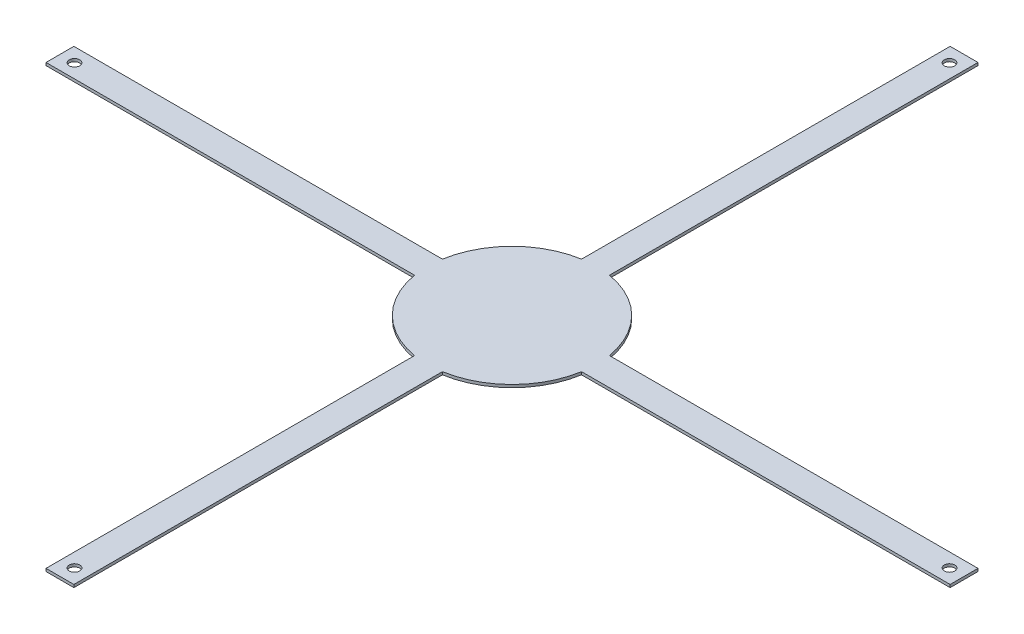
ISO-10303-21;
HEADER;
FILE_DESCRIPTION(('STEP AP214'),'2;1');
FILE_NAME('part.step','',(''),(''),'','','');
FILE_SCHEMA(('AUTOMOTIVE_DESIGN { 1 0 10303 214 1 1 1 1 }'));
ENDSEC;
DATA;
#1=APPLICATION_CONTEXT('core data for automotive mechanical design processes');
#2=APPLICATION_PROTOCOL_DEFINITION('international standard','automotive_design',2000,#1);
#3=PRODUCT_CONTEXT('',#1,'mechanical');
#4=PRODUCT('Part','Part','',(#3));
#5=PRODUCT_RELATED_PRODUCT_CATEGORY('part','',(#4));
#6=PRODUCT_DEFINITION_FORMATION('','',#4);
#7=PRODUCT_DEFINITION_CONTEXT('part definition',#1,'design');
#8=PRODUCT_DEFINITION('design','',#6,#7);
#9=PRODUCT_DEFINITION_SHAPE('','',#8);
#10=(LENGTH_UNIT() NAMED_UNIT(*) SI_UNIT(.MILLI.,.METRE.));
#11=(NAMED_UNIT(*) PLANE_ANGLE_UNIT() SI_UNIT($,.RADIAN.));
#12=(NAMED_UNIT(*) SI_UNIT($,.STERADIAN.) SOLID_ANGLE_UNIT());
#13=UNCERTAINTY_MEASURE_WITH_UNIT(LENGTH_MEASURE(1.E-05),#10,'distance_accuracy_value','');
#14=(GEOMETRIC_REPRESENTATION_CONTEXT(3) GLOBAL_UNCERTAINTY_ASSIGNED_CONTEXT((#13)) GLOBAL_UNIT_ASSIGNED_CONTEXT((#10,
#11,#12)) REPRESENTATION_CONTEXT('',''));
#15=CARTESIAN_POINT('',(0.,0.,0.));
#16=DIRECTION('',(0.,0.,1.));
#17=DIRECTION('',(1.,0.,0.));
#18=AXIS2_PLACEMENT_3D('',#15,#16,#17);
#19=CARTESIAN_POINT('',(-12.7,205.74,-1.33573707650214E-13));
#20=DIRECTION('',(1.,0.,0.));
#21=DIRECTION('',(0.,0.,1.));
#22=AXIS2_PLACEMENT_3D('',#19,#20,#21);
#23=PLANE('',#22);
#24=DIRECTION('',(0.,0.,-1.));
#25=VECTOR('',#24,1.);
#26=CARTESIAN_POINT('',(-12.6999999999992,208.28,12.7));
#27=LINE('',#26,#25);
#28=CARTESIAN_POINT('',(-12.6999999999966,208.28,-411.988633675264));
#29=VERTEX_POINT('',#28);
#30=CARTESIAN_POINT('',(-12.6999999999992,208.28,-76.0934795540916));
#31=VERTEX_POINT('',#30);
#32=EDGE_CURVE('E149',#29,#31,#27,.F.);
#33=ORIENTED_EDGE('',*,*,#32,.F.);
#34=DIRECTION('',(0.,1.,0.));
#35=VECTOR('',#34,1.);
#36=CARTESIAN_POINT('',(-12.6999999999966,205.74,-411.988633675264));
#37=LINE('',#36,#35);
#38=CARTESIAN_POINT('',(-12.6999999999966,205.74,-411.988633675264));
#39=VERTEX_POINT('',#38);
#40=EDGE_CURVE('E298',#39,#29,#37,.T.);
#41=ORIENTED_EDGE('',*,*,#40,.F.);
#42=DIRECTION('',(0.,0.,1.));
#43=VECTOR('',#42,1.);
#44=CARTESIAN_POINT('',(-12.7,205.74,-1.33573707650214E-13));
#45=LINE('',#44,#43);
#46=CARTESIAN_POINT('',(-12.6999999999992,205.74,-76.0934795540916));
#47=VERTEX_POINT('',#46);
#48=EDGE_CURVE('E169',#39,#47,#45,.T.);
#49=ORIENTED_EDGE('',*,*,#48,.T.);
#50=DIRECTION('',(0.,1.,0.));
#51=VECTOR('',#50,1.);
#52=CARTESIAN_POINT('',(-12.6999999999992,205.74,-76.0934795540916));
#53=LINE('',#52,#51);
#54=EDGE_CURVE('E12',#47,#31,#53,.T.);
#55=ORIENTED_EDGE('',*,*,#54,.T.);
#56=EDGE_LOOP('',(#33,#41,#49,#55));
#57=FACE_BOUND('',#56,.T.);
#58=ADVANCED_FACE('F59',(#57),#23,.F.);
#59=CARTESIAN_POINT('',(0.,205.74,0.));
#60=DIRECTION('',(0.,-1.,0.));
#61=DIRECTION('',(0.,0.,-1.));
#62=AXIS2_PLACEMENT_3D('',#59,#60,#61);
#63=CYLINDRICAL_SURFACE('',#62,77.1460150017416);
#64=ORIENTED_EDGE('',*,*,#54,.F.);
#65=CARTESIAN_POINT('',(0.,205.74,0.));
#66=DIRECTION('',(0.,1.,0.));
#67=DIRECTION('',(0.,0.,1.));
#68=AXIS2_PLACEMENT_3D('',#65,#66,#67);
#69=CIRCLE('',#68,77.1460150017416);
#70=CARTESIAN_POINT('',(-76.0934795540915,205.74,-12.7));
#71=VERTEX_POINT('',#70);
#72=EDGE_CURVE('E157',#47,#71,#69,.T.);
#73=ORIENTED_EDGE('',*,*,#72,.T.);
#74=DIRECTION('',(0.,1.,0.));
#75=VECTOR('',#74,1.);
#76=CARTESIAN_POINT('',(-76.0934795540915,205.74,-12.7));
#77=LINE('',#76,#75);
#78=CARTESIAN_POINT('',(-76.0934795540915,208.28,-12.7));
#79=VERTEX_POINT('',#78);
#80=EDGE_CURVE('E69',#71,#79,#77,.T.);
#81=ORIENTED_EDGE('',*,*,#80,.T.);
#82=CARTESIAN_POINT('',(0.,208.28,0.));
#83=DIRECTION('',(0.,1.,0.));
#84=DIRECTION('',(0.,0.,1.));
#85=AXIS2_PLACEMENT_3D('',#82,#83,#84);
#86=CIRCLE('',#85,77.1460150017416);
#87=EDGE_CURVE('E214',#31,#79,#86,.T.);
#88=ORIENTED_EDGE('',*,*,#87,.F.);
#89=EDGE_LOOP('',(#64,#73,#81,#88));
#90=FACE_BOUND('',#89,.T.);
#91=ADVANCED_FACE('F213',(#90),#63,.T.);
#92=CARTESIAN_POINT('',(0.,205.74,-12.7));
#93=DIRECTION('',(0.,0.,-1.));
#94=DIRECTION('',(1.,0.,0.));
#95=AXIS2_PLACEMENT_3D('',#92,#93,#94);
#96=PLANE('',#95);
#97=ORIENTED_EDGE('',*,*,#80,.F.);
#98=DIRECTION('',(1.,0.,0.));
#99=VECTOR('',#98,1.);
#100=CARTESIAN_POINT('',(0.,205.74,-12.7));
#101=LINE('',#100,#99);
#102=CARTESIAN_POINT('',(-411.988633675264,205.74,-12.7));
#103=VERTEX_POINT('',#102);
#104=EDGE_CURVE('E168',#103,#71,#101,.T.);
#105=ORIENTED_EDGE('',*,*,#104,.F.);
#106=DIRECTION('',(0.,1.,0.));
#107=VECTOR('',#106,1.);
#108=CARTESIAN_POINT('',(-411.988633675264,205.74,-12.7));
#109=LINE('',#108,#107);
#110=CARTESIAN_POINT('',(-411.988633675264,208.28,-12.7));
#111=VERTEX_POINT('',#110);
#112=EDGE_CURVE('E232',#103,#111,#109,.T.);
#113=ORIENTED_EDGE('',*,*,#112,.T.);
#114=DIRECTION('',(1.,0.,0.));
#115=VECTOR('',#114,1.);
#116=CARTESIAN_POINT('',(0.,208.28,-12.7));
#117=LINE('',#116,#115);
#118=EDGE_CURVE('E224',#111,#79,#117,.T.);
#119=ORIENTED_EDGE('',*,*,#118,.T.);
#120=EDGE_LOOP('',(#97,#105,#113,#119));
#121=FACE_BOUND('',#120,.T.);
#122=ADVANCED_FACE('F230',(#121),#96,.T.);
#123=CARTESIAN_POINT('',(0.,205.74,12.7));
#124=DIRECTION('',(0.,0.,-1.));
#125=DIRECTION('',(1.,0.,0.));
#126=AXIS2_PLACEMENT_3D('',#123,#124,#125);
#127=PLANE('',#126);
#128=DIRECTION('',(1.,0.,0.));
#129=VECTOR('',#128,1.);
#130=CARTESIAN_POINT('',(0.,208.28,12.7));
#131=LINE('',#130,#129);
#132=CARTESIAN_POINT('',(-411.988633675264,208.28,12.7));
#133=VERTEX_POINT('',#132);
#134=CARTESIAN_POINT('',(-76.0934795540915,208.28,12.7));
#135=VERTEX_POINT('',#134);
#136=EDGE_CURVE('E235',#133,#135,#131,.T.);
#137=ORIENTED_EDGE('',*,*,#136,.F.);
#138=DIRECTION('',(0.,1.,0.));
#139=VECTOR('',#138,1.);
#140=CARTESIAN_POINT('',(-411.988633675264,205.74,12.7));
#141=LINE('',#140,#139);
#142=CARTESIAN_POINT('',(-411.988633675264,205.74,12.7));
#143=VERTEX_POINT('',#142);
#144=EDGE_CURVE('E320',#143,#133,#141,.T.);
#145=ORIENTED_EDGE('',*,*,#144,.F.);
#146=DIRECTION('',(1.,0.,0.));
#147=VECTOR('',#146,1.);
#148=CARTESIAN_POINT('',(0.,205.74,12.7));
#149=LINE('',#148,#147);
#150=CARTESIAN_POINT('',(-76.0934795540915,205.74,12.7));
#151=VERTEX_POINT('',#150);
#152=EDGE_CURVE('E174',#143,#151,#149,.T.);
#153=ORIENTED_EDGE('',*,*,#152,.T.);
#154=DIRECTION('',(0.,1.,0.));
#155=VECTOR('',#154,1.);
#156=CARTESIAN_POINT('',(-76.0934795540915,205.74,12.7));
#157=LINE('',#156,#155);
#158=EDGE_CURVE('E208',#151,#135,#157,.T.);
#159=ORIENTED_EDGE('',*,*,#158,.T.);
#160=EDGE_LOOP('',(#137,#145,#153,#159));
#161=FACE_BOUND('',#160,.T.);
#162=ADVANCED_FACE('F419',(#161),#127,.F.);
#163=ORIENTED_EDGE('',*,*,#158,.F.);
#164=CARTESIAN_POINT('',(-12.7000000000003,205.74,76.0934795540914));
#165=VERTEX_POINT('',#164);
#166=EDGE_CURVE('E165',#151,#165,#69,.T.);
#167=ORIENTED_EDGE('',*,*,#166,.T.);
#168=DIRECTION('',(0.,1.,0.));
#169=VECTOR('',#168,1.);
#170=CARTESIAN_POINT('',(-12.7000000000003,205.74,76.0934795540914));
#171=LINE('',#170,#169);
#172=CARTESIAN_POINT('',(-12.7000000000003,208.28,76.0934795540914));
#173=VERTEX_POINT('',#172);
#174=EDGE_CURVE('E205',#165,#173,#171,.T.);
#175=ORIENTED_EDGE('',*,*,#174,.T.);
#176=CARTESIAN_POINT('',(0.,208.28,0.));
#177=DIRECTION('',(0.,1.,0.));
#178=DIRECTION('',(0.,0.,1.));
#179=AXIS2_PLACEMENT_3D('',#176,#177,#178);
#180=CIRCLE('',#179,77.1460150017416);
#181=EDGE_CURVE('E239',#135,#173,#180,.T.);
#182=ORIENTED_EDGE('',*,*,#181,.F.);
#183=EDGE_LOOP('',(#163,#167,#175,#182));
#184=FACE_BOUND('',#183,.T.);
#185=ADVANCED_FACE('F418',(#184),#63,.T.);
#186=CARTESIAN_POINT('',(-12.7,205.74,0.));
#187=DIRECTION('',(-1.,0.,0.));
#188=DIRECTION('',(0.,0.,-1.));
#189=AXIS2_PLACEMENT_3D('',#186,#187,#188);
#190=PLANE('',#189);
#191=ORIENTED_EDGE('',*,*,#174,.F.);
#192=DIRECTION('',(0.,0.,-1.));
#193=VECTOR('',#192,1.);
#194=CARTESIAN_POINT('',(-12.7,205.74,0.));
#195=LINE('',#194,#193);
#196=CARTESIAN_POINT('',(-12.7000000000011,205.74,411.988633675264));
#197=VERTEX_POINT('',#196);
#198=EDGE_CURVE('E179',#197,#165,#195,.T.);
#199=ORIENTED_EDGE('',*,*,#198,.F.);
#200=DIRECTION('',(0.,1.,0.));
#201=VECTOR('',#200,1.);
#202=CARTESIAN_POINT('',(-12.7000000000011,205.74,411.988633675264));
#203=LINE('',#202,#201);
#204=CARTESIAN_POINT('',(-12.7000000000011,208.28,411.988633675264));
#205=VERTEX_POINT('',#204);
#206=EDGE_CURVE('E353',#197,#205,#203,.T.);
#207=ORIENTED_EDGE('',*,*,#206,.T.);
#208=DIRECTION('',(0.,0.,-1.));
#209=VECTOR('',#208,1.);
#210=CARTESIAN_POINT('',(-12.7000000000003,208.28,12.7));
#211=LINE('',#210,#209);
#212=EDGE_CURVE('E247',#205,#173,#211,.T.);
#213=ORIENTED_EDGE('',*,*,#212,.T.);
#214=EDGE_LOOP('',(#191,#199,#207,#213));
#215=FACE_BOUND('',#214,.T.);
#216=ADVANCED_FACE('F416',(#215),#190,.T.);
#217=CARTESIAN_POINT('',(12.7,205.74,0.));
#218=DIRECTION('',(-1.,0.,0.));
#219=DIRECTION('',(0.,0.,-1.));
#220=AXIS2_PLACEMENT_3D('',#217,#218,#219);
#221=PLANE('',#220);
#222=DIRECTION('',(0.,0.,-1.));
#223=VECTOR('',#222,1.);
#224=CARTESIAN_POINT('',(12.6999999999997,208.28,12.7));
#225=LINE('',#224,#223);
#226=CARTESIAN_POINT('',(12.6999999999989,208.28,411.988633675264));
#227=VERTEX_POINT('',#226);
#228=CARTESIAN_POINT('',(12.6999999999997,208.28,76.0934795540915));
#229=VERTEX_POINT('',#228);
#230=EDGE_CURVE('E251',#227,#229,#225,.T.);
#231=ORIENTED_EDGE('',*,*,#230,.F.);
#232=DIRECTION('',(0.,1.,0.));
#233=VECTOR('',#232,1.);
#234=CARTESIAN_POINT('',(12.6999999999989,205.74,411.988633675264));
#235=LINE('',#234,#233);
#236=CARTESIAN_POINT('',(12.6999999999989,205.74,411.988633675264));
#237=VERTEX_POINT('',#236);
#238=EDGE_CURVE('E341',#237,#227,#235,.T.);
#239=ORIENTED_EDGE('',*,*,#238,.F.);
#240=DIRECTION('',(0.,0.,-1.));
#241=VECTOR('',#240,1.);
#242=CARTESIAN_POINT('',(12.7,205.74,0.));
#243=LINE('',#242,#241);
#244=CARTESIAN_POINT('',(12.6999999999997,205.74,76.0934795540915));
#245=VERTEX_POINT('',#244);
#246=EDGE_CURVE('E151',#237,#245,#243,.T.);
#247=ORIENTED_EDGE('',*,*,#246,.T.);
#248=DIRECTION('',(0.,1.,0.));
#249=VECTOR('',#248,1.);
#250=CARTESIAN_POINT('',(12.6999999999997,205.74,76.0934795540915));
#251=LINE('',#250,#249);
#252=EDGE_CURVE('E202',#245,#229,#251,.T.);
#253=ORIENTED_EDGE('',*,*,#252,.T.);
#254=EDGE_LOOP('',(#231,#239,#247,#253));
#255=FACE_BOUND('',#254,.T.);
#256=ADVANCED_FACE('F414',(#255),#221,.F.);
#257=ORIENTED_EDGE('',*,*,#252,.F.);
#258=CARTESIAN_POINT('',(76.0934795540915,205.74,12.7));
#259=VERTEX_POINT('',#258);
#260=EDGE_CURVE('E156',#245,#259,#69,.T.);
#261=ORIENTED_EDGE('',*,*,#260,.T.);
#262=DIRECTION('',(0.,1.,0.));
#263=VECTOR('',#262,1.);
#264=CARTESIAN_POINT('',(76.0934795540915,205.74,12.7));
#265=LINE('',#264,#263);
#266=CARTESIAN_POINT('',(76.0934795540915,208.28,12.7));
#267=VERTEX_POINT('',#266);
#268=EDGE_CURVE('E199',#259,#267,#265,.T.);
#269=ORIENTED_EDGE('',*,*,#268,.T.);
#270=CARTESIAN_POINT('',(0.,208.28,0.));
#271=DIRECTION('',(0.,1.,0.));
#272=DIRECTION('',(0.,0.,1.));
#273=AXIS2_PLACEMENT_3D('',#270,#271,#272);
#274=CIRCLE('',#273,77.1460150017416);
#275=EDGE_CURVE('E255',#229,#267,#274,.T.);
#276=ORIENTED_EDGE('',*,*,#275,.F.);
#277=EDGE_LOOP('',(#257,#261,#269,#276));
#278=FACE_BOUND('',#277,.T.);
#279=ADVANCED_FACE('F412',(#278),#63,.T.);
#280=CARTESIAN_POINT('',(0.,205.74,12.7));
#281=DIRECTION('',(0.,0.,1.));
#282=DIRECTION('',(-1.,0.,0.));
#283=AXIS2_PLACEMENT_3D('',#280,#281,#282);
#284=PLANE('',#283);
#285=ORIENTED_EDGE('',*,*,#268,.F.);
#286=DIRECTION('',(-1.,0.,0.));
#287=VECTOR('',#286,1.);
#288=CARTESIAN_POINT('',(0.,205.74,12.7));
#289=LINE('',#288,#287);
#290=CARTESIAN_POINT('',(411.988633675264,205.74,12.7));
#291=VERTEX_POINT('',#290);
#292=EDGE_CURVE('E159',#291,#259,#289,.T.);
#293=ORIENTED_EDGE('',*,*,#292,.F.);
#294=DIRECTION('',(0.,1.,0.));
#295=VECTOR('',#294,1.);
#296=CARTESIAN_POINT('',(411.988633675264,205.74,12.7));
#297=LINE('',#296,#295);
#298=CARTESIAN_POINT('',(411.988633675264,208.28,12.7));
#299=VERTEX_POINT('',#298);
#300=EDGE_CURVE('E289',#291,#299,#297,.T.);
#301=ORIENTED_EDGE('',*,*,#300,.T.);
#302=DIRECTION('',(1.,0.,0.));
#303=VECTOR('',#302,1.);
#304=CARTESIAN_POINT('',(0.,208.28,12.7));
#305=LINE('',#304,#303);
#306=EDGE_CURVE('E259',#299,#267,#305,.F.);
#307=ORIENTED_EDGE('',*,*,#306,.T.);
#308=EDGE_LOOP('',(#285,#293,#301,#307));
#309=FACE_BOUND('',#308,.T.);
#310=ADVANCED_FACE('F404',(#309),#284,.T.);
#311=CARTESIAN_POINT('',(0.,205.74,-12.7));
#312=DIRECTION('',(0.,0.,1.));
#313=DIRECTION('',(-1.,0.,0.));
#314=AXIS2_PLACEMENT_3D('',#311,#312,#313);
#315=PLANE('',#314);
#316=DIRECTION('',(1.,0.,0.));
#317=VECTOR('',#316,1.);
#318=CARTESIAN_POINT('',(0.,208.28,-12.7));
#319=LINE('',#318,#317);
#320=CARTESIAN_POINT('',(411.988633675264,208.28,-12.7));
#321=VERTEX_POINT('',#320);
#322=CARTESIAN_POINT('',(76.0934795540915,208.28,-12.7));
#323=VERTEX_POINT('',#322);
#324=EDGE_CURVE('E263',#321,#323,#319,.F.);
#325=ORIENTED_EDGE('',*,*,#324,.F.);
#326=DIRECTION('',(0.,1.,0.));
#327=VECTOR('',#326,1.);
#328=CARTESIAN_POINT('',(411.988633675264,205.74,-12.7));
#329=LINE('',#328,#327);
#330=CARTESIAN_POINT('',(411.988633675264,205.74,-12.7));
#331=VERTEX_POINT('',#330);
#332=EDGE_CURVE('E276',#331,#321,#329,.T.);
#333=ORIENTED_EDGE('',*,*,#332,.F.);
#334=DIRECTION('',(-1.,0.,0.));
#335=VECTOR('',#334,1.);
#336=CARTESIAN_POINT('',(0.,205.74,-12.7));
#337=LINE('',#336,#335);
#338=CARTESIAN_POINT('',(76.0934795540915,205.74,-12.7));
#339=VERTEX_POINT('',#338);
#340=EDGE_CURVE('E154',#331,#339,#337,.T.);
#341=ORIENTED_EDGE('',*,*,#340,.T.);
#342=DIRECTION('',(0.,1.,0.));
#343=VECTOR('',#342,1.);
#344=CARTESIAN_POINT('',(76.0934795540915,205.74,-12.7));
#345=LINE('',#344,#343);
#346=EDGE_CURVE('E122',#339,#323,#345,.T.);
#347=ORIENTED_EDGE('',*,*,#346,.T.);
#348=EDGE_LOOP('',(#325,#333,#341,#347));
#349=FACE_BOUND('',#348,.T.);
#350=ADVANCED_FACE('F410',(#349),#315,.F.);
#351=ORIENTED_EDGE('',*,*,#346,.F.);
#352=CARTESIAN_POINT('',(12.7000000000003,205.74,-76.0934795540914));
#353=VERTEX_POINT('',#352);
#354=EDGE_CURVE('E143',#339,#353,#69,.T.);
#355=ORIENTED_EDGE('',*,*,#354,.T.);
#356=DIRECTION('',(0.,1.,0.));
#357=VECTOR('',#356,1.);
#358=CARTESIAN_POINT('',(12.7000000000003,205.74,-76.0934795540914));
#359=LINE('',#358,#357);
#360=CARTESIAN_POINT('',(12.7000000000003,208.28,-76.0934795540914));
#361=VERTEX_POINT('',#360);
#362=EDGE_CURVE('E77',#353,#361,#359,.T.);
#363=ORIENTED_EDGE('',*,*,#362,.T.);
#364=CARTESIAN_POINT('',(0.,208.28,0.));
#365=DIRECTION('',(0.,1.,0.));
#366=DIRECTION('',(0.,0.,1.));
#367=AXIS2_PLACEMENT_3D('',#364,#365,#366);
#368=CIRCLE('',#367,77.1460150017416);
#369=EDGE_CURVE('E267',#323,#361,#368,.T.);
#370=ORIENTED_EDGE('',*,*,#369,.F.);
#371=EDGE_LOOP('',(#351,#355,#363,#370));
#372=FACE_BOUND('',#371,.T.);
#373=ADVANCED_FACE('F152',(#372),#63,.T.);
#374=ORIENTED_EDGE('',*,*,#362,.F.);
#375=CARTESIAN_POINT('',(12.7000000000034,205.74,-411.988633675264));
#376=VERTEX_POINT('',#375);
#377=EDGE_CURVE('E131',#353,#376,#243,.T.);
#378=ORIENTED_EDGE('',*,*,#377,.T.);
#379=DIRECTION('',(0.,1.,0.));
#380=VECTOR('',#379,1.);
#381=CARTESIAN_POINT('',(12.7000000000034,205.74,-411.988633675264));
#382=LINE('',#381,#380);
#383=CARTESIAN_POINT('',(12.7000000000034,208.28,-411.988633675264));
#384=VERTEX_POINT('',#383);
#385=EDGE_CURVE('E311',#376,#384,#382,.T.);
#386=ORIENTED_EDGE('',*,*,#385,.T.);
#387=DIRECTION('',(0.,0.,-1.));
#388=VECTOR('',#387,1.);
#389=CARTESIAN_POINT('',(12.7000000000003,208.28,12.7));
#390=LINE('',#389,#388);
#391=EDGE_CURVE('E134',#361,#384,#390,.T.);
#392=ORIENTED_EDGE('',*,*,#391,.F.);
#393=EDGE_LOOP('',(#374,#378,#386,#392));
#394=FACE_BOUND('',#393,.T.);
#395=ADVANCED_FACE('F128',(#394),#221,.F.);
#396=CARTESIAN_POINT('',(0.,208.28,12.7));
#397=DIRECTION('',(0.,-1.,0.));
#398=DIRECTION('',(0.,0.,-1.));
#399=AXIS2_PLACEMENT_3D('',#396,#397,#398);
#400=PLANE('',#399);
#401=ORIENTED_EDGE('',*,*,#118,.F.);
#402=DIRECTION('',(0.,0.,1.));
#403=VECTOR('',#402,1.);
#404=CARTESIAN_POINT('',(-411.988633675264,208.28,-12.7));
#405=LINE('',#404,#403);
#406=EDGE_CURVE('E299',#111,#133,#405,.T.);
#407=ORIENTED_EDGE('',*,*,#406,.T.);
#408=ORIENTED_EDGE('',*,*,#136,.T.);
#409=ORIENTED_EDGE('',*,*,#181,.T.);
#410=ORIENTED_EDGE('',*,*,#212,.F.);
#411=DIRECTION('',(1.,0.,0.));
#412=VECTOR('',#411,1.);
#413=CARTESIAN_POINT('',(-12.700000000001,208.28,411.988633675264));
#414=LINE('',#413,#412);
#415=EDGE_CURVE('E321',#205,#227,#414,.T.);
#416=ORIENTED_EDGE('',*,*,#415,.T.);
#417=ORIENTED_EDGE('',*,*,#230,.T.);
#418=ORIENTED_EDGE('',*,*,#275,.T.);
#419=ORIENTED_EDGE('',*,*,#306,.F.);
#420=DIRECTION('',(0.,0.,1.));
#421=VECTOR('',#420,1.);
#422=CARTESIAN_POINT('',(411.988633675264,208.28,12.7));
#423=LINE('',#422,#421);
#424=EDGE_CURVE('E176',#299,#321,#423,.F.);
#425=ORIENTED_EDGE('',*,*,#424,.T.);
#426=ORIENTED_EDGE('',*,*,#324,.T.);
#427=ORIENTED_EDGE('',*,*,#369,.T.);
#428=ORIENTED_EDGE('',*,*,#391,.T.);
#429=DIRECTION('',(1.,0.,0.));
#430=VECTOR('',#429,1.);
#431=CARTESIAN_POINT('',(12.7000000000031,208.28,-411.988633675264));
#432=LINE('',#431,#430);
#433=EDGE_CURVE('E277',#384,#29,#432,.F.);
#434=ORIENTED_EDGE('',*,*,#433,.T.);
#435=ORIENTED_EDGE('',*,*,#32,.T.);
#436=ORIENTED_EDGE('',*,*,#87,.T.);
#437=EDGE_LOOP('',(#401,#407,#408,#409,#410,#416,#417,#418,#419,#425,#426,#427,#428,#434,#435,#436));
#438=FACE_BOUND('',#437,.T.);
#439=CARTESIAN_POINT('',(398.727854033753,208.28,0.));
#440=DIRECTION('',(0.,-1.,0.));
#441=DIRECTION('',(1.,0.,0.));
#442=AXIS2_PLACEMENT_3D('',#439,#440,#441);
#443=CIRCLE('',#442,4.76250000000001);
#444=CARTESIAN_POINT('',(403.490354033753,208.28,0.));
#445=VERTEX_POINT('',#444);
#446=EDGE_CURVE('E281',#445,#445,#443,.F.);
#447=ORIENTED_EDGE('',*,*,#446,.F.);
#448=EDGE_LOOP('',(#447));
#449=FACE_BOUND('',#448,.T.);
#450=CARTESIAN_POINT('',(3.29013543964733E-12,208.28,-398.727854033753));
#451=DIRECTION('',(0.,-1.,0.));
#452=DIRECTION('',(0.,0.,-1.));
#453=AXIS2_PLACEMENT_3D('',#450,#451,#452);
#454=CIRCLE('',#453,4.76250000000001);
#455=CARTESIAN_POINT('',(3.26878910927549E-12,208.28,-403.490354033753));
#456=VERTEX_POINT('',#455);
#457=EDGE_CURVE('E303',#456,#456,#454,.F.);
#458=ORIENTED_EDGE('',*,*,#457,.F.);
#459=EDGE_LOOP('',(#458));
#460=FACE_BOUND('',#459,.T.);
#461=CARTESIAN_POINT('',(-398.727854033753,208.28,0.));
#462=DIRECTION('',(0.,-1.,0.));
#463=DIRECTION('',(1.,0.,0.));
#464=AXIS2_PLACEMENT_3D('',#461,#462,#463);
#465=CIRCLE('',#464,4.76250000000001);
#466=CARTESIAN_POINT('',(-393.965354033753,208.28,0.));
#467=VERTEX_POINT('',#466);
#468=EDGE_CURVE('E325',#467,#467,#465,.F.);
#469=ORIENTED_EDGE('',*,*,#468,.F.);
#470=EDGE_LOOP('',(#469));
#471=FACE_BOUND('',#470,.T.);
#472=CARTESIAN_POINT('',(-1.09440315767574E-12,208.28,398.727854033754));
#473=DIRECTION('',(0.,-1.,0.));
#474=DIRECTION('',(0.,0.,-1.));
#475=AXIS2_PLACEMENT_3D('',#472,#473,#474);
#476=CIRCLE('',#475,4.76250000000001);
#477=CARTESIAN_POINT('',(-1.10151860113302E-12,208.28,393.965354033754));
#478=VERTEX_POINT('',#477);
#479=EDGE_CURVE('E345',#478,#478,#476,.F.);
#480=ORIENTED_EDGE('',*,*,#479,.F.);
#481=EDGE_LOOP('',(#480));
#482=FACE_BOUND('',#481,.T.);
#483=ADVANCED_FACE('F61',(#438,#449,#460,#471,#482),#400,.F.);
#484=CARTESIAN_POINT('',(0.,205.74,12.7));
#485=DIRECTION('',(0.,-1.,0.));
#486=DIRECTION('',(0.,0.,-1.));
#487=AXIS2_PLACEMENT_3D('',#484,#485,#486);
#488=PLANE('',#487);
#489=ORIENTED_EDGE('',*,*,#104,.T.);
#490=ORIENTED_EDGE('',*,*,#72,.F.);
#491=ORIENTED_EDGE('',*,*,#48,.F.);
#492=DIRECTION('',(-1.,0.,0.));
#493=VECTOR('',#492,1.);
#494=CARTESIAN_POINT('',(12.7000000000034,205.74,-411.988633675264));
#495=LINE('',#494,#493);
#496=EDGE_CURVE('E147',#376,#39,#495,.T.);
#497=ORIENTED_EDGE('',*,*,#496,.F.);
#498=ORIENTED_EDGE('',*,*,#377,.F.);
#499=ORIENTED_EDGE('',*,*,#354,.F.);
#500=ORIENTED_EDGE('',*,*,#340,.F.);
#501=DIRECTION('',(0.,0.,-1.));
#502=VECTOR('',#501,1.);
#503=CARTESIAN_POINT('',(411.988633675264,205.74,12.7));
#504=LINE('',#503,#502);
#505=EDGE_CURVE('E272',#291,#331,#504,.T.);
#506=ORIENTED_EDGE('',*,*,#505,.F.);
#507=ORIENTED_EDGE('',*,*,#292,.T.);
#508=ORIENTED_EDGE('',*,*,#260,.F.);
#509=ORIENTED_EDGE('',*,*,#246,.F.);
#510=DIRECTION('',(1.,0.,0.));
#511=VECTOR('',#510,1.);
#512=CARTESIAN_POINT('',(-12.7000000000011,205.74,411.988633675264));
#513=LINE('',#512,#511);
#514=EDGE_CURVE('E337',#197,#237,#513,.T.);
#515=ORIENTED_EDGE('',*,*,#514,.F.);
#516=ORIENTED_EDGE('',*,*,#198,.T.);
#517=ORIENTED_EDGE('',*,*,#166,.F.);
#518=ORIENTED_EDGE('',*,*,#152,.F.);
#519=DIRECTION('',(0.,0.,1.));
#520=VECTOR('',#519,1.);
#521=CARTESIAN_POINT('',(-411.988633675264,205.74,-12.7));
#522=LINE('',#521,#520);
#523=EDGE_CURVE('E316',#103,#143,#522,.T.);
#524=ORIENTED_EDGE('',*,*,#523,.F.);
#525=EDGE_LOOP('',(#489,#490,#491,#497,#498,#499,#500,#506,#507,#508,#509,#515,#516,#517,#518,#524));
#526=FACE_BOUND('',#525,.T.);
#527=CARTESIAN_POINT('',(398.727854033753,205.74,0.));
#528=DIRECTION('',(0.,-1.,0.));
#529=DIRECTION('',(1.,0.,0.));
#530=AXIS2_PLACEMENT_3D('',#527,#528,#529);
#531=CIRCLE('',#530,4.76250000000001);
#532=CARTESIAN_POINT('',(403.490354033753,205.74,0.));
#533=VERTEX_POINT('',#532);
#534=EDGE_CURVE('E285',#533,#533,#531,.F.);
#535=ORIENTED_EDGE('',*,*,#534,.T.);
#536=EDGE_LOOP('',(#535));
#537=FACE_BOUND('',#536,.T.);
#538=CARTESIAN_POINT('',(3.28589524043182E-12,205.74,-398.727854033753));
#539=DIRECTION('',(0.,-1.,0.));
#540=DIRECTION('',(0.,0.,-1.));
#541=AXIS2_PLACEMENT_3D('',#538,#539,#540);
#542=CIRCLE('',#541,4.76250000000001);
#543=CARTESIAN_POINT('',(3.26454891005998E-12,205.74,-403.490354033753));
#544=VERTEX_POINT('',#543);
#545=EDGE_CURVE('E307',#544,#544,#542,.F.);
#546=ORIENTED_EDGE('',*,*,#545,.T.);
#547=EDGE_LOOP('',(#546));
#548=FACE_BOUND('',#547,.T.);
#549=CARTESIAN_POINT('',(-398.727854033753,205.74,0.));
#550=DIRECTION('',(0.,-1.,0.));
#551=DIRECTION('',(1.,0.,0.));
#552=AXIS2_PLACEMENT_3D('',#549,#550,#551);
#553=CIRCLE('',#552,4.76250000000001);
#554=CARTESIAN_POINT('',(-393.965354033753,205.74,0.));
#555=VERTEX_POINT('',#554);
#556=EDGE_CURVE('E329',#555,#555,#553,.F.);
#557=ORIENTED_EDGE('',*,*,#556,.T.);
#558=EDGE_LOOP('',(#557));
#559=FACE_BOUND('',#558,.T.);
#560=CARTESIAN_POINT('',(-1.09298975793724E-12,205.74,398.727854033754));
#561=DIRECTION('',(0.,-1.,0.));
#562=DIRECTION('',(0.,0.,-1.));
#563=AXIS2_PLACEMENT_3D('',#560,#561,#562);
#564=CIRCLE('',#563,4.76250000000001);
#565=CARTESIAN_POINT('',(-1.10010520139452E-12,205.74,393.965354033754));
#566=VERTEX_POINT('',#565);
#567=EDGE_CURVE('E349',#566,#566,#564,.F.);
#568=ORIENTED_EDGE('',*,*,#567,.T.);
#569=EDGE_LOOP('',(#568));
#570=FACE_BOUND('',#569,.T.);
#571=ADVANCED_FACE('F140',(#526,#537,#548,#559,#570),#488,.T.);
#572=CARTESIAN_POINT('',(411.988633675264,205.74,12.7));
#573=DIRECTION('',(-1.,0.,0.));
#574=DIRECTION('',(0.,0.,-1.));
#575=AXIS2_PLACEMENT_3D('',#572,#573,#574);
#576=PLANE('',#575);
#577=ORIENTED_EDGE('',*,*,#300,.F.);
#578=ORIENTED_EDGE('',*,*,#505,.T.);
#579=ORIENTED_EDGE('',*,*,#332,.T.);
#580=ORIENTED_EDGE('',*,*,#424,.F.);
#581=EDGE_LOOP('',(#577,#578,#579,#580));
#582=FACE_BOUND('',#581,.T.);
#583=ADVANCED_FACE('F409',(#582),#576,.F.);
#584=CARTESIAN_POINT('',(398.727854033753,205.74,0.));
#585=DIRECTION('',(0.,-1.,0.));
#586=DIRECTION('',(1.,0.,0.));
#587=AXIS2_PLACEMENT_3D('',#584,#585,#586);
#588=CYLINDRICAL_SURFACE('',#587,4.76250000000001);
#589=ORIENTED_EDGE('',*,*,#446,.T.);
#590=EDGE_LOOP('',(#589));
#591=FACE_BOUND('',#590,.T.);
#592=ORIENTED_EDGE('',*,*,#534,.F.);
#593=EDGE_LOOP('',(#592));
#594=FACE_BOUND('',#593,.T.);
#595=ADVANCED_FACE('F430',(#591,#594),#588,.F.);
#596=CARTESIAN_POINT('',(12.7000000000034,205.74,-411.988633675264));
#597=DIRECTION('',(0.,0.,1.));
#598=DIRECTION('',(-1.,0.,0.));
#599=AXIS2_PLACEMENT_3D('',#596,#597,#598);
#600=PLANE('',#599);
#601=ORIENTED_EDGE('',*,*,#385,.F.);
#602=ORIENTED_EDGE('',*,*,#496,.T.);
#603=ORIENTED_EDGE('',*,*,#40,.T.);
#604=ORIENTED_EDGE('',*,*,#433,.F.);
#605=EDGE_LOOP('',(#601,#602,#603,#604));
#606=FACE_BOUND('',#605,.T.);
#607=ADVANCED_FACE('F427',(#606),#600,.F.);
#608=CARTESIAN_POINT('',(3.28589524043182E-12,205.74,-398.727854033753));
#609=DIRECTION('',(0.,-1.,0.));
#610=DIRECTION('',(0.,0.,-1.));
#611=AXIS2_PLACEMENT_3D('',#608,#609,#610);
#612=CYLINDRICAL_SURFACE('',#611,4.76250000000001);
#613=ORIENTED_EDGE('',*,*,#457,.T.);
#614=EDGE_LOOP('',(#613));
#615=FACE_BOUND('',#614,.T.);
#616=ORIENTED_EDGE('',*,*,#545,.F.);
#617=EDGE_LOOP('',(#616));
#618=FACE_BOUND('',#617,.T.);
#619=ADVANCED_FACE('F429',(#615,#618),#612,.F.);
#620=CARTESIAN_POINT('',(-411.988633675264,205.74,-12.7));
#621=DIRECTION('',(1.,0.,0.));
#622=DIRECTION('',(0.,0.,1.));
#623=AXIS2_PLACEMENT_3D('',#620,#621,#622);
#624=PLANE('',#623);
#625=ORIENTED_EDGE('',*,*,#112,.F.);
#626=ORIENTED_EDGE('',*,*,#523,.T.);
#627=ORIENTED_EDGE('',*,*,#144,.T.);
#628=ORIENTED_EDGE('',*,*,#406,.F.);
#629=EDGE_LOOP('',(#625,#626,#627,#628));
#630=FACE_BOUND('',#629,.T.);
#631=ADVANCED_FACE('F421',(#630),#624,.F.);
#632=CARTESIAN_POINT('',(-398.727854033753,205.74,0.));
#633=DIRECTION('',(0.,-1.,0.));
#634=DIRECTION('',(1.,0.,0.));
#635=AXIS2_PLACEMENT_3D('',#632,#633,#634);
#636=CYLINDRICAL_SURFACE('',#635,4.76250000000001);
#637=ORIENTED_EDGE('',*,*,#468,.T.);
#638=EDGE_LOOP('',(#637));
#639=FACE_BOUND('',#638,.T.);
#640=ORIENTED_EDGE('',*,*,#556,.F.);
#641=EDGE_LOOP('',(#640));
#642=FACE_BOUND('',#641,.T.);
#643=ADVANCED_FACE('F495',(#639,#642),#636,.F.);
#644=CARTESIAN_POINT('',(-12.7000000000011,205.74,411.988633675264));
#645=DIRECTION('',(0.,0.,-1.));
#646=DIRECTION('',(1.,0.,0.));
#647=AXIS2_PLACEMENT_3D('',#644,#645,#646);
#648=PLANE('',#647);
#649=ORIENTED_EDGE('',*,*,#206,.F.);
#650=ORIENTED_EDGE('',*,*,#514,.T.);
#651=ORIENTED_EDGE('',*,*,#238,.T.);
#652=ORIENTED_EDGE('',*,*,#415,.F.);
#653=EDGE_LOOP('',(#649,#650,#651,#652));
#654=FACE_BOUND('',#653,.T.);
#655=ADVANCED_FACE('F370',(#654),#648,.F.);
#656=CARTESIAN_POINT('',(-1.09298975793724E-12,205.74,398.727854033754));
#657=DIRECTION('',(0.,-1.,0.));
#658=DIRECTION('',(0.,0.,-1.));
#659=AXIS2_PLACEMENT_3D('',#656,#657,#658);
#660=CYLINDRICAL_SURFACE('',#659,4.76250000000001);
#661=ORIENTED_EDGE('',*,*,#479,.T.);
#662=EDGE_LOOP('',(#661));
#663=FACE_BOUND('',#662,.T.);
#664=ORIENTED_EDGE('',*,*,#567,.F.);
#665=EDGE_LOOP('',(#664));
#666=FACE_BOUND('',#665,.T.);
#667=ADVANCED_FACE('F514',(#663,#666),#660,.F.);
#668=CLOSED_SHELL('',(#58,#91,#122,#162,#185,#216,#256,#279,#310,#350,#373,#395,#483,#571,#583,
#595,#607,#619,#631,#643,#655,#667));
#669=MANIFOLD_SOLID_BREP('B2',#668);
#670=ADVANCED_BREP_SHAPE_REPRESENTATION('',(#18,#669),#14);
#671=SHAPE_DEFINITION_REPRESENTATION(#9,#670);
ENDSEC;
END-ISO-10303-21;
